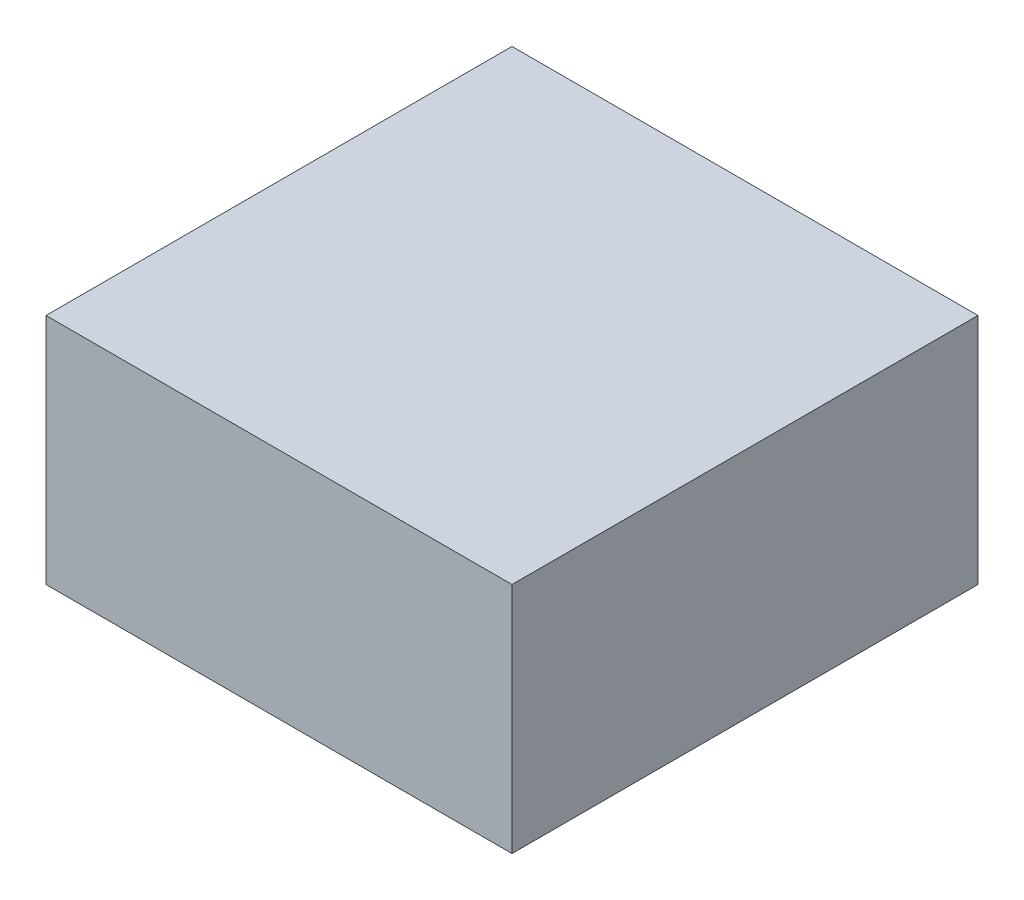
ISO-10303-21;
HEADER;
FILE_DESCRIPTION(('STEP AP214'),'2;1');
FILE_NAME('part.step','',(''),(''),'','','');
FILE_SCHEMA(('AUTOMOTIVE_DESIGN { 1 0 10303 214 1 1 1 1 }'));
ENDSEC;
DATA;
#1=APPLICATION_CONTEXT('core data for automotive mechanical design processes');
#2=APPLICATION_PROTOCOL_DEFINITION('international standard','automotive_design',2000,#1);
#3=PRODUCT_CONTEXT('',#1,'mechanical');
#4=PRODUCT('Part','Part','',(#3));
#5=PRODUCT_RELATED_PRODUCT_CATEGORY('part','',(#4));
#6=PRODUCT_DEFINITION_FORMATION('','',#4);
#7=PRODUCT_DEFINITION_CONTEXT('part definition',#1,'design');
#8=PRODUCT_DEFINITION('design','',#6,#7);
#9=PRODUCT_DEFINITION_SHAPE('','',#8);
#10=(LENGTH_UNIT() NAMED_UNIT(*) SI_UNIT(.MILLI.,.METRE.));
#11=(NAMED_UNIT(*) PLANE_ANGLE_UNIT() SI_UNIT($,.RADIAN.));
#12=(NAMED_UNIT(*) SI_UNIT($,.STERADIAN.) SOLID_ANGLE_UNIT());
#13=UNCERTAINTY_MEASURE_WITH_UNIT(LENGTH_MEASURE(1.E-05),#10,'distance_accuracy_value','');
#14=(GEOMETRIC_REPRESENTATION_CONTEXT(3) GLOBAL_UNCERTAINTY_ASSIGNED_CONTEXT((#13)) GLOBAL_UNIT_ASSIGNED_CONTEXT((#10,
#11,#12)) REPRESENTATION_CONTEXT('',''));
#15=CARTESIAN_POINT('',(0.,0.,0.));
#16=DIRECTION('',(0.,0.,1.));
#17=DIRECTION('',(1.,0.,0.));
#18=AXIS2_PLACEMENT_3D('',#15,#16,#17);
#19=CARTESIAN_POINT('',(0.5,0.,0.500000000000004));
#20=DIRECTION('',(0.,0.,-1.));
#21=DIRECTION('',(0.,1.,0.));
#22=AXIS2_PLACEMENT_3D('',#19,#20,#21);
#23=PLANE('',#22);
#24=DIRECTION('',(0.,-1.,0.));
#25=VECTOR('',#24,1.);
#26=CARTESIAN_POINT('',(-0.5,0.,0.500000000000004));
#27=LINE('',#26,#25);
#28=CARTESIAN_POINT('',(-0.5,0.,0.500000000000004));
#29=VERTEX_POINT('',#28);
#30=CARTESIAN_POINT('',(-0.5,-0.5,0.5));
#31=VERTEX_POINT('',#30);
#32=EDGE_CURVE('E98',#29,#31,#27,.T.);
#33=ORIENTED_EDGE('',*,*,#32,.T.);
#34=DIRECTION('',(-1.,0.,0.));
#35=VECTOR('',#34,1.);
#36=CARTESIAN_POINT('',(0.5,-0.5,0.5));
#37=LINE('',#36,#35);
#38=CARTESIAN_POINT('',(0.5,-0.5,0.5));
#39=VERTEX_POINT('',#38);
#40=EDGE_CURVE('E11',#39,#31,#37,.T.);
#41=ORIENTED_EDGE('',*,*,#40,.F.);
#42=DIRECTION('',(0.,-1.,0.));
#43=VECTOR('',#42,1.);
#44=CARTESIAN_POINT('',(0.5,0.,0.500000000000004));
#45=LINE('',#44,#43);
#46=CARTESIAN_POINT('',(0.5,0.,0.500000000000004));
#47=VERTEX_POINT('',#46);
#48=EDGE_CURVE('E86',#47,#39,#45,.T.);
#49=ORIENTED_EDGE('',*,*,#48,.F.);
#50=DIRECTION('',(-1.,0.,0.));
#51=VECTOR('',#50,1.);
#52=CARTESIAN_POINT('',(0.5,0.,0.500000000000004));
#53=LINE('',#52,#51);
#54=EDGE_CURVE('E94',#47,#29,#53,.T.);
#55=ORIENTED_EDGE('',*,*,#54,.T.);
#56=EDGE_LOOP('',(#33,#41,#49,#55));
#57=FACE_BOUND('',#56,.T.);
#58=ADVANCED_FACE('F35',(#57),#23,.F.);
#59=CARTESIAN_POINT('',(0.5,-0.5,0.5));
#60=DIRECTION('',(0.,1.,0.));
#61=DIRECTION('',(0.,0.,1.));
#62=AXIS2_PLACEMENT_3D('',#59,#60,#61);
#63=PLANE('',#62);
#64=DIRECTION('',(0.,0.,-1.));
#65=VECTOR('',#64,1.);
#66=CARTESIAN_POINT('',(-0.5,-0.5,0.5));
#67=LINE('',#66,#65);
#68=CARTESIAN_POINT('',(-0.5,-0.5,-0.5));
#69=VERTEX_POINT('',#68);
#70=EDGE_CURVE('E90',#31,#69,#67,.T.);
#71=ORIENTED_EDGE('',*,*,#70,.T.);
#72=DIRECTION('',(-1.,0.,0.));
#73=VECTOR('',#72,1.);
#74=CARTESIAN_POINT('',(0.5,-0.5,-0.5));
#75=LINE('',#74,#73);
#76=CARTESIAN_POINT('',(0.5,-0.5,-0.5));
#77=VERTEX_POINT('',#76);
#78=EDGE_CURVE('E43',#77,#69,#75,.T.);
#79=ORIENTED_EDGE('',*,*,#78,.F.);
#80=DIRECTION('',(0.,0.,-1.));
#81=VECTOR('',#80,1.);
#82=CARTESIAN_POINT('',(0.5,-0.5,0.5));
#83=LINE('',#82,#81);
#84=EDGE_CURVE('E81',#39,#77,#83,.T.);
#85=ORIENTED_EDGE('',*,*,#84,.F.);
#86=ORIENTED_EDGE('',*,*,#40,.T.);
#87=EDGE_LOOP('',(#71,#79,#85,#86));
#88=FACE_BOUND('',#87,.T.);
#89=ADVANCED_FACE('F89',(#88),#63,.F.);
#90=CARTESIAN_POINT('',(0.5,0.,-0.500000000000004));
#91=DIRECTION('',(0.,0.,1.));
#92=DIRECTION('',(0.,-1.,0.));
#93=AXIS2_PLACEMENT_3D('',#90,#91,#92);
#94=PLANE('',#93);
#95=DIRECTION('',(0.,1.,0.));
#96=VECTOR('',#95,1.);
#97=CARTESIAN_POINT('',(-0.5,0.,-0.500000000000004));
#98=LINE('',#97,#96);
#99=CARTESIAN_POINT('',(-0.5,0.,-0.500000000000004));
#100=VERTEX_POINT('',#99);
#101=EDGE_CURVE('E68',#69,#100,#98,.T.);
#102=ORIENTED_EDGE('',*,*,#101,.T.);
#103=DIRECTION('',(-1.,0.,0.));
#104=VECTOR('',#103,1.);
#105=CARTESIAN_POINT('',(0.5,0.,-0.500000000000004));
#106=LINE('',#105,#104);
#107=CARTESIAN_POINT('',(0.5,0.,-0.500000000000004));
#108=VERTEX_POINT('',#107);
#109=EDGE_CURVE('E91',#108,#100,#106,.T.);
#110=ORIENTED_EDGE('',*,*,#109,.F.);
#111=DIRECTION('',(0.,1.,0.));
#112=VECTOR('',#111,1.);
#113=CARTESIAN_POINT('',(0.5,0.,-0.500000000000004));
#114=LINE('',#113,#112);
#115=EDGE_CURVE('E84',#77,#108,#114,.T.);
#116=ORIENTED_EDGE('',*,*,#115,.F.);
#117=ORIENTED_EDGE('',*,*,#78,.T.);
#118=EDGE_LOOP('',(#102,#110,#116,#117));
#119=FACE_BOUND('',#118,.T.);
#120=ADVANCED_FACE('F92',(#119),#94,.F.);
#121=CARTESIAN_POINT('',(0.5,0.,0.500000000000004));
#122=DIRECTION('',(0.,-1.,0.));
#123=DIRECTION('',(0.,0.,-1.));
#124=AXIS2_PLACEMENT_3D('',#121,#122,#123);
#125=PLANE('',#124);
#126=DIRECTION('',(0.,0.,1.));
#127=VECTOR('',#126,1.);
#128=CARTESIAN_POINT('',(-0.5,0.,0.500000000000004));
#129=LINE('',#128,#127);
#130=EDGE_CURVE('E74',#100,#29,#129,.T.);
#131=ORIENTED_EDGE('',*,*,#130,.T.);
#132=ORIENTED_EDGE('',*,*,#54,.F.);
#133=DIRECTION('',(0.,0.,1.));
#134=VECTOR('',#133,1.);
#135=CARTESIAN_POINT('',(0.5,0.,0.500000000000004));
#136=LINE('',#135,#134);
#137=EDGE_CURVE('E51',#108,#47,#136,.T.);
#138=ORIENTED_EDGE('',*,*,#137,.F.);
#139=ORIENTED_EDGE('',*,*,#109,.T.);
#140=EDGE_LOOP('',(#131,#132,#138,#139));
#141=FACE_BOUND('',#140,.T.);
#142=ADVANCED_FACE('F105',(#141),#125,.F.);
#143=CARTESIAN_POINT('',(0.5,0.,0.));
#144=DIRECTION('',(1.,0.,0.));
#145=DIRECTION('',(0.,0.,-1.));
#146=AXIS2_PLACEMENT_3D('',#143,#144,#145);
#147=PLANE('',#146);
#148=ORIENTED_EDGE('',*,*,#48,.T.);
#149=ORIENTED_EDGE('',*,*,#84,.T.);
#150=ORIENTED_EDGE('',*,*,#115,.T.);
#151=ORIENTED_EDGE('',*,*,#137,.T.);
#152=EDGE_LOOP('',(#148,#149,#150,#151));
#153=FACE_BOUND('',#152,.T.);
#154=ADVANCED_FACE('F82',(#153),#147,.T.);
#155=CARTESIAN_POINT('',(-0.5,0.,0.));
#156=DIRECTION('',(1.,0.,0.));
#157=DIRECTION('',(0.,0.,-1.));
#158=AXIS2_PLACEMENT_3D('',#155,#156,#157);
#159=PLANE('',#158);
#160=ORIENTED_EDGE('',*,*,#32,.F.);
#161=ORIENTED_EDGE('',*,*,#130,.F.);
#162=ORIENTED_EDGE('',*,*,#101,.F.);
#163=ORIENTED_EDGE('',*,*,#70,.F.);
#164=EDGE_LOOP('',(#160,#161,#162,#163));
#165=FACE_BOUND('',#164,.T.);
#166=ADVANCED_FACE('F108',(#165),#159,.F.);
#167=CLOSED_SHELL('',(#58,#89,#120,#142,#154,#166));
#168=MANIFOLD_SOLID_BREP('B2',#167);
#169=ADVANCED_BREP_SHAPE_REPRESENTATION('',(#18,#168),#14);
#170=SHAPE_DEFINITION_REPRESENTATION(#9,#169);
ENDSEC;
END-ISO-10303-21;
